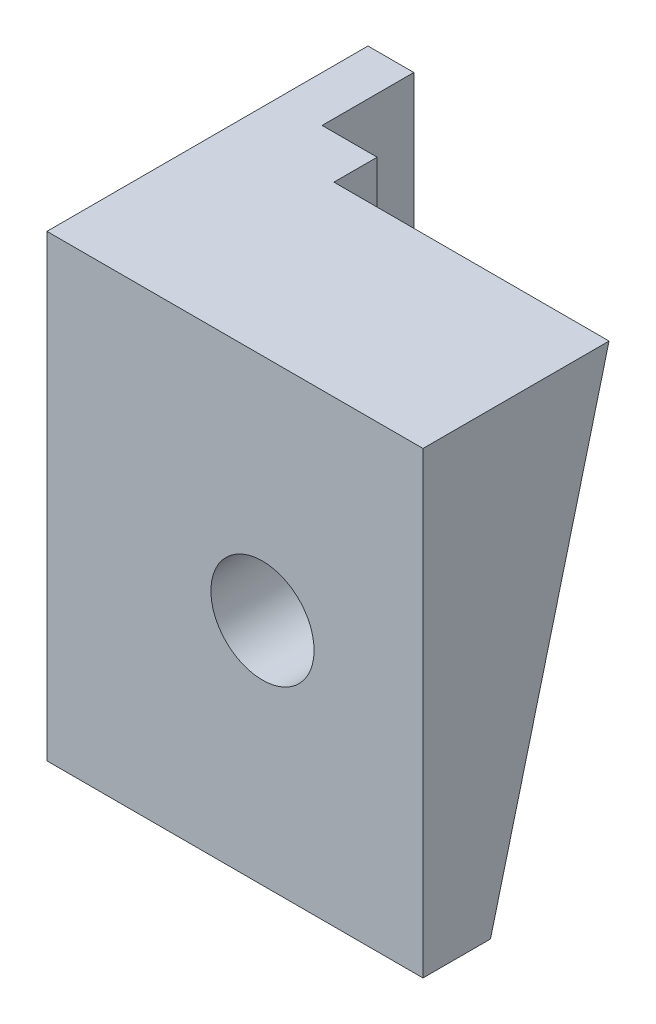
ISO-10303-21;
HEADER;
FILE_DESCRIPTION(('STEP AP214'),'2;1');
FILE_NAME('part.step','',(''),(''),'','','');
FILE_SCHEMA(('AUTOMOTIVE_DESIGN { 1 0 10303 214 1 1 1 1 }'));
ENDSEC;
DATA;
#1=APPLICATION_CONTEXT('core data for automotive mechanical design processes');
#2=APPLICATION_PROTOCOL_DEFINITION('international standard','automotive_design',2000,#1);
#3=PRODUCT_CONTEXT('',#1,'mechanical');
#4=PRODUCT('Part','Part','',(#3));
#5=PRODUCT_RELATED_PRODUCT_CATEGORY('part','',(#4));
#6=PRODUCT_DEFINITION_FORMATION('','',#4);
#7=PRODUCT_DEFINITION_CONTEXT('part definition',#1,'design');
#8=PRODUCT_DEFINITION('design','',#6,#7);
#9=PRODUCT_DEFINITION_SHAPE('','',#8);
#10=(LENGTH_UNIT() NAMED_UNIT(*) SI_UNIT(.MILLI.,.METRE.));
#11=(NAMED_UNIT(*) PLANE_ANGLE_UNIT() SI_UNIT($,.RADIAN.));
#12=(NAMED_UNIT(*) SI_UNIT($,.STERADIAN.) SOLID_ANGLE_UNIT());
#13=UNCERTAINTY_MEASURE_WITH_UNIT(LENGTH_MEASURE(1.E-05),#10,'distance_accuracy_value','');
#14=(GEOMETRIC_REPRESENTATION_CONTEXT(3) GLOBAL_UNCERTAINTY_ASSIGNED_CONTEXT((#13)) GLOBAL_UNIT_ASSIGNED_CONTEXT((#10,
#11,#12)) REPRESENTATION_CONTEXT('',''));
#15=CARTESIAN_POINT('',(0.,0.,0.));
#16=DIRECTION('',(0.,0.,1.));
#17=DIRECTION('',(1.,0.,0.));
#18=AXIS2_PLACEMENT_3D('',#15,#16,#17);
#19=CARTESIAN_POINT('',(2.2,0.,5.));
#20=DIRECTION('',(-1.,0.,0.));
#21=DIRECTION('',(0.,-1.,0.));
#22=AXIS2_PLACEMENT_3D('',#19,#20,#21);
#23=PLANE('',#22);
#24=DIRECTION('',(0.,0.968147640378109,-0.250380004054438));
#25=VECTOR('',#24,1.);
#26=CARTESIAN_POINT('',(2.2,0.855453868885387,3.30779467690096));
#27=LINE('',#26,#25);
#28=CARTESIAN_POINT('',(2.2,0.,3.52903009));
#29=VERTEX_POINT('',#28);
#30=CARTESIAN_POINT('',(2.2,10.,0.942854246441133));
#31=VERTEX_POINT('',#30);
#32=EDGE_CURVE('E49',#29,#31,#27,.T.);
#33=ORIENTED_EDGE('',*,*,#32,.F.);
#34=DIRECTION('',(0.,0.,-1.));
#35=VECTOR('',#34,1.);
#36=CARTESIAN_POINT('',(2.2,0.,5.));
#37=LINE('',#36,#35);
#38=CARTESIAN_POINT('',(2.2,0.,0.));
#39=VERTEX_POINT('',#38);
#40=EDGE_CURVE('E11',#29,#39,#37,.T.);
#41=ORIENTED_EDGE('',*,*,#40,.T.);
#42=DIRECTION('',(0.,1.,0.));
#43=VECTOR('',#42,1.);
#44=CARTESIAN_POINT('',(2.2,0.,0.));
#45=LINE('',#44,#43);
#46=CARTESIAN_POINT('',(2.2,10.,0.));
#47=VERTEX_POINT('',#46);
#48=EDGE_CURVE('E153',#39,#47,#45,.T.);
#49=ORIENTED_EDGE('',*,*,#48,.T.);
#50=DIRECTION('',(0.,0.,-1.));
#51=VECTOR('',#50,1.);
#52=CARTESIAN_POINT('',(2.2,10.,5.));
#53=LINE('',#52,#51);
#54=EDGE_CURVE('E43',#31,#47,#53,.T.);
#55=ORIENTED_EDGE('',*,*,#54,.F.);
#56=EDGE_LOOP('',(#33,#41,#49,#55));
#57=FACE_BOUND('',#56,.T.);
#58=ADVANCED_FACE('F34',(#57),#23,.F.);
#59=CARTESIAN_POINT('',(0.,0.,5.));
#60=DIRECTION('',(0.,1.,0.));
#61=DIRECTION('',(0.,0.,1.));
#62=AXIS2_PLACEMENT_3D('',#59,#60,#61);
#63=PLANE('',#62);
#64=DIRECTION('',(0.,0.,-1.));
#65=VECTOR('',#64,1.);
#66=CARTESIAN_POINT('',(0.,0.,5.));
#67=LINE('',#66,#65);
#68=CARTESIAN_POINT('',(0.,0.,5.));
#69=VERTEX_POINT('',#68);
#70=CARTESIAN_POINT('',(0.,0.,-2.));
#71=VERTEX_POINT('',#70);
#72=EDGE_CURVE('E151',#69,#71,#67,.T.);
#73=ORIENTED_EDGE('',*,*,#72,.T.);
#74=DIRECTION('',(1.,0.,0.));
#75=VECTOR('',#74,1.);
#76=CARTESIAN_POINT('',(0.,0.,-2.));
#77=LINE('',#76,#75);
#78=CARTESIAN_POINT('',(1.,0.,-2.));
#79=VERTEX_POINT('',#78);
#80=EDGE_CURVE('E125',#71,#79,#77,.T.);
#81=ORIENTED_EDGE('',*,*,#80,.T.);
#82=DIRECTION('',(0.,0.,1.));
#83=VECTOR('',#82,1.);
#84=CARTESIAN_POINT('',(1.,0.,-2.));
#85=LINE('',#84,#83);
#86=CARTESIAN_POINT('',(1.,0.,0.));
#87=VERTEX_POINT('',#86);
#88=EDGE_CURVE('E138',#79,#87,#85,.T.);
#89=ORIENTED_EDGE('',*,*,#88,.T.);
#90=DIRECTION('',(1.,0.,0.));
#91=VECTOR('',#90,1.);
#92=CARTESIAN_POINT('',(0.,0.,0.));
#93=LINE('',#92,#91);
#94=EDGE_CURVE('E141',#87,#39,#93,.T.);
#95=ORIENTED_EDGE('',*,*,#94,.T.);
#96=ORIENTED_EDGE('',*,*,#40,.F.);
#97=DIRECTION('',(-1.,0.,0.));
#98=VECTOR('',#97,1.);
#99=CARTESIAN_POINT('',(8.2,0.,3.52903009));
#100=LINE('',#99,#98);
#101=CARTESIAN_POINT('',(8.2,0.,3.52903009));
#102=VERTEX_POINT('',#101);
#103=EDGE_CURVE('E105',#102,#29,#100,.T.);
#104=ORIENTED_EDGE('',*,*,#103,.F.);
#105=DIRECTION('',(0.,0.,-1.));
#106=VECTOR('',#105,1.);
#107=CARTESIAN_POINT('',(8.2,0.,0.));
#108=LINE('',#107,#106);
#109=CARTESIAN_POINT('',(8.2,0.,5.));
#110=VERTEX_POINT('',#109);
#111=EDGE_CURVE('E112',#110,#102,#108,.T.);
#112=ORIENTED_EDGE('',*,*,#111,.F.);
#113=DIRECTION('',(1.,0.,0.));
#114=VECTOR('',#113,1.);
#115=CARTESIAN_POINT('',(0.,0.,5.));
#116=LINE('',#115,#114);
#117=EDGE_CURVE('E143',#69,#110,#116,.T.);
#118=ORIENTED_EDGE('',*,*,#117,.F.);
#119=EDGE_LOOP('',(#73,#81,#89,#95,#96,#104,#112,#118));
#120=FACE_BOUND('',#119,.T.);
#121=ADVANCED_FACE('F36',(#120),#63,.F.);
#122=CARTESIAN_POINT('',(0.,10.,5.));
#123=DIRECTION('',(0.,1.,0.));
#124=DIRECTION('',(0.,0.,1.));
#125=AXIS2_PLACEMENT_3D('',#122,#123,#124);
#126=PLANE('',#125);
#127=DIRECTION('',(1.,0.,0.));
#128=VECTOR('',#127,1.);
#129=CARTESIAN_POINT('',(0.,10.,0.));
#130=LINE('',#129,#128);
#131=CARTESIAN_POINT('',(1.,10.,0.));
#132=VERTEX_POINT('',#131);
#133=EDGE_CURVE('E146',#132,#47,#130,.T.);
#134=ORIENTED_EDGE('',*,*,#133,.F.);
#135=DIRECTION('',(0.,0.,1.));
#136=VECTOR('',#135,1.);
#137=CARTESIAN_POINT('',(0.999999999999999,10.,-2.));
#138=LINE('',#137,#136);
#139=CARTESIAN_POINT('',(0.999999999999999,10.,-2.));
#140=VERTEX_POINT('',#139);
#141=EDGE_CURVE('E57',#140,#132,#138,.T.);
#142=ORIENTED_EDGE('',*,*,#141,.F.);
#143=DIRECTION('',(1.,0.,0.));
#144=VECTOR('',#143,1.);
#145=CARTESIAN_POINT('',(0.,10.,-2.));
#146=LINE('',#145,#144);
#147=CARTESIAN_POINT('',(0.,10.,-2.));
#148=VERTEX_POINT('',#147);
#149=EDGE_CURVE('E134',#148,#140,#146,.T.);
#150=ORIENTED_EDGE('',*,*,#149,.F.);
#151=DIRECTION('',(0.,0.,-1.));
#152=VECTOR('',#151,1.);
#153=CARTESIAN_POINT('',(0.,10.,5.));
#154=LINE('',#153,#152);
#155=CARTESIAN_POINT('',(0.,10.,5.));
#156=VERTEX_POINT('',#155);
#157=EDGE_CURVE('E159',#156,#148,#154,.T.);
#158=ORIENTED_EDGE('',*,*,#157,.F.);
#159=DIRECTION('',(1.,0.,0.));
#160=VECTOR('',#159,1.);
#161=CARTESIAN_POINT('',(0.,10.,5.));
#162=LINE('',#161,#160);
#163=CARTESIAN_POINT('',(8.2,10.,5.));
#164=VERTEX_POINT('',#163);
#165=EDGE_CURVE('E145',#156,#164,#162,.T.);
#166=ORIENTED_EDGE('',*,*,#165,.T.);
#167=DIRECTION('',(0.,0.,1.));
#168=VECTOR('',#167,1.);
#169=CARTESIAN_POINT('',(8.2,10.,0.));
#170=LINE('',#169,#168);
#171=CARTESIAN_POINT('',(8.2,10.,0.942854246441133));
#172=VERTEX_POINT('',#171);
#173=EDGE_CURVE('E111',#172,#164,#170,.T.);
#174=ORIENTED_EDGE('',*,*,#173,.F.);
#175=DIRECTION('',(-1.,0.,0.));
#176=VECTOR('',#175,1.);
#177=CARTESIAN_POINT('',(8.2,10.,0.942854246441133));
#178=LINE('',#177,#176);
#179=EDGE_CURVE('E107',#172,#31,#178,.T.);
#180=ORIENTED_EDGE('',*,*,#179,.T.);
#181=ORIENTED_EDGE('',*,*,#54,.T.);
#182=EDGE_LOOP('',(#134,#142,#150,#158,#166,#174,#180,#181));
#183=FACE_BOUND('',#182,.T.);
#184=ADVANCED_FACE('F163',(#183),#126,.T.);
#185=CARTESIAN_POINT('',(0.,0.,5.));
#186=DIRECTION('',(-1.,0.,0.));
#187=DIRECTION('',(0.,-1.,0.));
#188=AXIS2_PLACEMENT_3D('',#185,#186,#187);
#189=PLANE('',#188);
#190=ORIENTED_EDGE('',*,*,#157,.T.);
#191=DIRECTION('',(0.,1.,0.));
#192=VECTOR('',#191,1.);
#193=CARTESIAN_POINT('',(0.,0.,-2.));
#194=LINE('',#193,#192);
#195=EDGE_CURVE('E136',#71,#148,#194,.T.);
#196=ORIENTED_EDGE('',*,*,#195,.F.);
#197=ORIENTED_EDGE('',*,*,#72,.F.);
#198=DIRECTION('',(0.,1.,0.));
#199=VECTOR('',#198,1.);
#200=CARTESIAN_POINT('',(0.,0.,5.));
#201=LINE('',#200,#199);
#202=EDGE_CURVE('E148',#69,#156,#201,.T.);
#203=ORIENTED_EDGE('',*,*,#202,.T.);
#204=EDGE_LOOP('',(#190,#196,#197,#203));
#205=FACE_BOUND('',#204,.T.);
#206=ADVANCED_FACE('F190',(#205),#189,.T.);
#207=CARTESIAN_POINT('',(0.,0.,5.));
#208=DIRECTION('',(0.,0.,1.));
#209=DIRECTION('',(1.,0.,0.));
#210=AXIS2_PLACEMENT_3D('',#207,#208,#209);
#211=PLANE('',#210);
#212=CARTESIAN_POINT('',(4.7,5.,5.));
#213=DIRECTION('',(0.,0.,1.));
#214=DIRECTION('',(1.,0.,0.));
#215=AXIS2_PLACEMENT_3D('',#212,#213,#214);
#216=CIRCLE('',#215,1.125);
#217=CARTESIAN_POINT('',(5.825,5.,5.));
#218=VERTEX_POINT('',#217);
#219=EDGE_CURVE('E200',#218,#218,#216,.T.);
#220=ORIENTED_EDGE('',*,*,#219,.F.);
#221=EDGE_LOOP('',(#220));
#222=FACE_BOUND('',#221,.T.);
#223=ORIENTED_EDGE('',*,*,#117,.T.);
#224=DIRECTION('',(0.,-1.,0.));
#225=VECTOR('',#224,1.);
#226=CARTESIAN_POINT('',(8.2,0.,5.));
#227=LINE('',#226,#225);
#228=EDGE_CURVE('E118',#164,#110,#227,.T.);
#229=ORIENTED_EDGE('',*,*,#228,.F.);
#230=ORIENTED_EDGE('',*,*,#165,.F.);
#231=ORIENTED_EDGE('',*,*,#202,.F.);
#232=EDGE_LOOP('',(#223,#229,#230,#231));
#233=FACE_BOUND('',#232,.T.);
#234=ADVANCED_FACE('F180',(#222,#233),#211,.T.);
#235=CARTESIAN_POINT('',(0.,0.,0.));
#236=DIRECTION('',(0.,0.,1.));
#237=DIRECTION('',(1.,0.,0.));
#238=AXIS2_PLACEMENT_3D('',#235,#236,#237);
#239=PLANE('',#238);
#240=ORIENTED_EDGE('',*,*,#94,.F.);
#241=DIRECTION('',(0.,1.,0.));
#242=VECTOR('',#241,1.);
#243=CARTESIAN_POINT('',(1.,0.,0.));
#244=LINE('',#243,#242);
#245=EDGE_CURVE('E123',#87,#132,#244,.T.);
#246=ORIENTED_EDGE('',*,*,#245,.T.);
#247=ORIENTED_EDGE('',*,*,#133,.T.);
#248=ORIENTED_EDGE('',*,*,#48,.F.);
#249=EDGE_LOOP('',(#240,#246,#247,#248));
#250=FACE_BOUND('',#249,.T.);
#251=ADVANCED_FACE('F167',(#250),#239,.F.);
#252=CARTESIAN_POINT('',(1.,0.,-2.));
#253=DIRECTION('',(1.,0.,0.));
#254=DIRECTION('',(0.,1.,0.));
#255=AXIS2_PLACEMENT_3D('',#252,#253,#254);
#256=PLANE('',#255);
#257=ORIENTED_EDGE('',*,*,#245,.F.);
#258=ORIENTED_EDGE('',*,*,#88,.F.);
#259=DIRECTION('',(0.,1.,0.));
#260=VECTOR('',#259,1.);
#261=CARTESIAN_POINT('',(1.,0.,-2.));
#262=LINE('',#261,#260);
#263=EDGE_CURVE('E132',#79,#140,#262,.T.);
#264=ORIENTED_EDGE('',*,*,#263,.T.);
#265=ORIENTED_EDGE('',*,*,#141,.T.);
#266=EDGE_LOOP('',(#257,#258,#264,#265));
#267=FACE_BOUND('',#266,.T.);
#268=ADVANCED_FACE('F170',(#267),#256,.T.);
#269=CARTESIAN_POINT('',(0.,0.,-2.));
#270=DIRECTION('',(0.,0.,1.));
#271=DIRECTION('',(1.,0.,0.));
#272=AXIS2_PLACEMENT_3D('',#269,#270,#271);
#273=PLANE('',#272);
#274=ORIENTED_EDGE('',*,*,#80,.F.);
#275=ORIENTED_EDGE('',*,*,#195,.T.);
#276=ORIENTED_EDGE('',*,*,#149,.T.);
#277=ORIENTED_EDGE('',*,*,#263,.F.);
#278=EDGE_LOOP('',(#274,#275,#276,#277));
#279=FACE_BOUND('',#278,.T.);
#280=ADVANCED_FACE('F172',(#279),#273,.F.);
#281=CARTESIAN_POINT('',(8.2,0.855453868885386,3.30779467690096));
#282=DIRECTION('',(0.,0.250380004054438,0.968147640378109));
#283=DIRECTION('',(0.,-0.968147640378109,0.250380004054438));
#284=AXIS2_PLACEMENT_3D('',#281,#282,#283);
#285=PLANE('',#284);
#286=CARTESIAN_POINT('',(4.7,5.,2.23594216822057));
#287=DIRECTION('',(0.,0.250380004054438,0.968147640378109));
#288=DIRECTION('',(0.,-0.968147640378109,0.250380004054438));
#289=AXIS2_PLACEMENT_3D('',#286,#287,#288);
#290=ELLIPSE('',#289,1.1620128512224,1.125);
#291=CARTESIAN_POINT('',(4.7,3.875,2.52688695062094));
#292=VERTEX_POINT('',#291);
#293=EDGE_CURVE('E38',#292,#292,#290,.T.);
#294=ORIENTED_EDGE('',*,*,#293,.T.);
#295=EDGE_LOOP('',(#294));
#296=FACE_BOUND('',#295,.T.);
#297=ORIENTED_EDGE('',*,*,#32,.T.);
#298=ORIENTED_EDGE('',*,*,#179,.F.);
#299=DIRECTION('',(0.,0.968147640378109,-0.250380004054438));
#300=VECTOR('',#299,1.);
#301=CARTESIAN_POINT('',(8.2,0.855453868885386,3.30779467690096));
#302=LINE('',#301,#300);
#303=EDGE_CURVE('E101',#102,#172,#302,.T.);
#304=ORIENTED_EDGE('',*,*,#303,.F.);
#305=ORIENTED_EDGE('',*,*,#103,.T.);
#306=EDGE_LOOP('',(#297,#298,#304,#305));
#307=FACE_BOUND('',#306,.T.);
#308=ADVANCED_FACE('F103',(#296,#307),#285,.F.);
#309=CARTESIAN_POINT('',(8.2,0.,0.));
#310=DIRECTION('',(1.,0.,0.));
#311=DIRECTION('',(0.,1.,0.));
#312=AXIS2_PLACEMENT_3D('',#309,#310,#311);
#313=PLANE('',#312);
#314=ORIENTED_EDGE('',*,*,#111,.T.);
#315=ORIENTED_EDGE('',*,*,#303,.T.);
#316=ORIENTED_EDGE('',*,*,#173,.T.);
#317=ORIENTED_EDGE('',*,*,#228,.T.);
#318=EDGE_LOOP('',(#314,#315,#316,#317));
#319=FACE_BOUND('',#318,.T.);
#320=ADVANCED_FACE('F116',(#319),#313,.T.);
#321=CARTESIAN_POINT('',(4.7,5.,-1.));
#322=DIRECTION('',(0.,0.,1.));
#323=DIRECTION('',(1.,0.,0.));
#324=AXIS2_PLACEMENT_3D('',#321,#322,#323);
#325=CYLINDRICAL_SURFACE('',#324,1.125);
#326=ORIENTED_EDGE('',*,*,#219,.T.);
#327=EDGE_LOOP('',(#326));
#328=FACE_BOUND('',#327,.T.);
#329=ORIENTED_EDGE('',*,*,#293,.F.);
#330=EDGE_LOOP('',(#329));
#331=FACE_BOUND('',#330,.T.);
#332=ADVANCED_FACE('F212',(#328,#331),#325,.F.);
#333=CLOSED_SHELL('',(#58,#121,#184,#206,#234,#251,#268,#280,#308,#320,#332));
#334=MANIFOLD_SOLID_BREP('B2',#333);
#335=ADVANCED_BREP_SHAPE_REPRESENTATION('',(#18,#334),#14);
#336=SHAPE_DEFINITION_REPRESENTATION(#9,#335);
ENDSEC;
END-ISO-10303-21;
